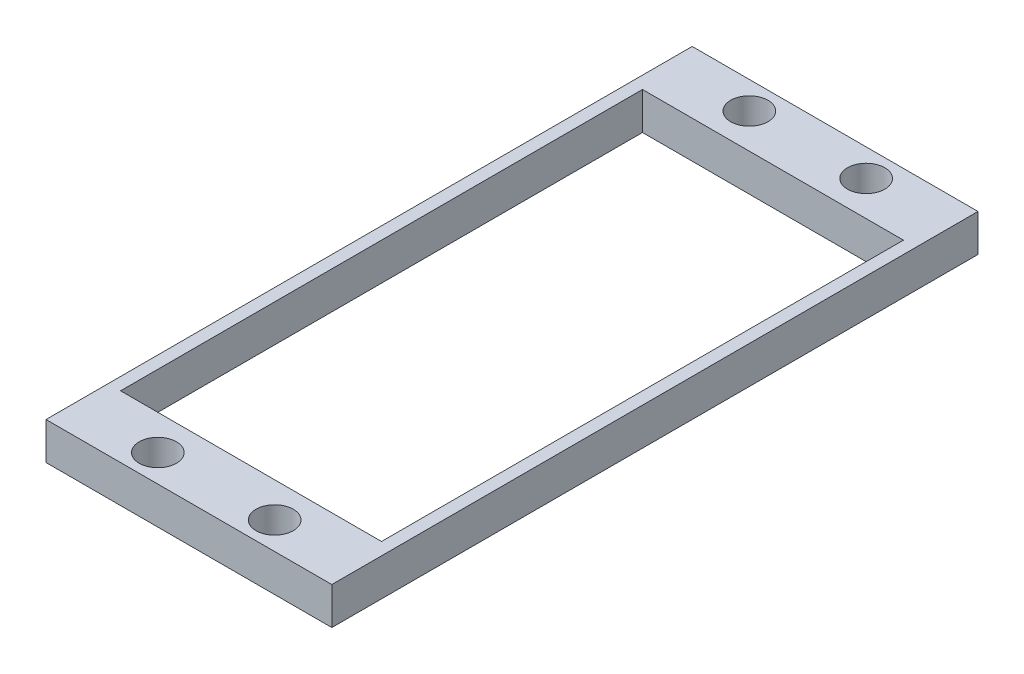
ISO-10303-21;
HEADER;
FILE_DESCRIPTION(('STEP AP214'),'2;1');
FILE_NAME('part.step','',(''),(''),'','','');
FILE_SCHEMA(('AUTOMOTIVE_DESIGN { 1 0 10303 214 1 1 1 1 }'));
ENDSEC;
DATA;
#1=APPLICATION_CONTEXT('core data for automotive mechanical design processes');
#2=APPLICATION_PROTOCOL_DEFINITION('international standard','automotive_design',2000,#1);
#3=PRODUCT_CONTEXT('',#1,'mechanical');
#4=PRODUCT('Part','Part','',(#3));
#5=PRODUCT_RELATED_PRODUCT_CATEGORY('part','',(#4));
#6=PRODUCT_DEFINITION_FORMATION('','',#4);
#7=PRODUCT_DEFINITION_CONTEXT('part definition',#1,'design');
#8=PRODUCT_DEFINITION('design','',#6,#7);
#9=PRODUCT_DEFINITION_SHAPE('','',#8);
#10=(LENGTH_UNIT() NAMED_UNIT(*) SI_UNIT(.MILLI.,.METRE.));
#11=(NAMED_UNIT(*) PLANE_ANGLE_UNIT() SI_UNIT($,.RADIAN.));
#12=(NAMED_UNIT(*) SI_UNIT($,.STERADIAN.) SOLID_ANGLE_UNIT());
#13=UNCERTAINTY_MEASURE_WITH_UNIT(LENGTH_MEASURE(1.E-05),#10,'distance_accuracy_value','');
#14=(GEOMETRIC_REPRESENTATION_CONTEXT(3) GLOBAL_UNCERTAINTY_ASSIGNED_CONTEXT((#13)) GLOBAL_UNIT_ASSIGNED_CONTEXT((#10,
#11,#12)) REPRESENTATION_CONTEXT('',''));
#15=CARTESIAN_POINT('',(0.,0.,0.));
#16=DIRECTION('',(0.,0.,1.));
#17=DIRECTION('',(1.,0.,0.));
#18=AXIS2_PLACEMENT_3D('',#15,#16,#17);
#19=CARTESIAN_POINT('',(0.,3.,0.));
#20=DIRECTION('',(0.,-1.,0.));
#21=DIRECTION('',(0.,0.,-1.));
#22=AXIS2_PLACEMENT_3D('',#19,#20,#21);
#23=PLANE('',#22);
#24=DIRECTION('',(0.,0.,1.));
#25=VECTOR('',#24,1.);
#26=CARTESIAN_POINT('',(-11.5,3.,-22.));
#27=LINE('',#26,#25);
#28=CARTESIAN_POINT('',(-11.5,3.,-26.));
#29=VERTEX_POINT('',#28);
#30=CARTESIAN_POINT('',(-11.5,3.,26.));
#31=VERTEX_POINT('',#30);
#32=EDGE_CURVE('E140',#29,#31,#27,.T.);
#33=ORIENTED_EDGE('',*,*,#32,.T.);
#34=DIRECTION('',(1.,0.,0.));
#35=VECTOR('',#34,1.);
#36=CARTESIAN_POINT('',(-11.5,3.,26.));
#37=LINE('',#36,#35);
#38=CARTESIAN_POINT('',(11.5,3.,26.));
#39=VERTEX_POINT('',#38);
#40=EDGE_CURVE('E142',#31,#39,#37,.T.);
#41=ORIENTED_EDGE('',*,*,#40,.T.);
#42=DIRECTION('',(0.,0.,-1.));
#43=VECTOR('',#42,1.);
#44=CARTESIAN_POINT('',(11.5,3.,22.));
#45=LINE('',#44,#43);
#46=CARTESIAN_POINT('',(11.5,3.,-26.));
#47=VERTEX_POINT('',#46);
#48=EDGE_CURVE('E145',#39,#47,#45,.T.);
#49=ORIENTED_EDGE('',*,*,#48,.T.);
#50=DIRECTION('',(-1.,0.,0.));
#51=VECTOR('',#50,1.);
#52=CARTESIAN_POINT('',(-11.5,3.,-26.));
#53=LINE('',#52,#51);
#54=EDGE_CURVE('E147',#47,#29,#53,.T.);
#55=ORIENTED_EDGE('',*,*,#54,.T.);
#56=EDGE_LOOP('',(#33,#41,#49,#55));
#57=FACE_BOUND('',#56,.T.);
#58=DIRECTION('',(0.,0.,1.));
#59=VECTOR('',#58,1.);
#60=CARTESIAN_POINT('',(-10.5,3.,-21.));
#61=LINE('',#60,#59);
#62=CARTESIAN_POINT('',(-10.5,3.,-21.));
#63=VERTEX_POINT('',#62);
#64=CARTESIAN_POINT('',(-10.5,3.,21.));
#65=VERTEX_POINT('',#64);
#66=EDGE_CURVE('E101',#63,#65,#61,.T.);
#67=ORIENTED_EDGE('',*,*,#66,.F.);
#68=DIRECTION('',(-1.,0.,0.));
#69=VECTOR('',#68,1.);
#70=CARTESIAN_POINT('',(-10.5,3.,-21.));
#71=LINE('',#70,#69);
#72=CARTESIAN_POINT('',(10.5,3.,-21.));
#73=VERTEX_POINT('',#72);
#74=EDGE_CURVE('E124',#73,#63,#71,.T.);
#75=ORIENTED_EDGE('',*,*,#74,.F.);
#76=DIRECTION('',(0.,0.,-1.));
#77=VECTOR('',#76,1.);
#78=CARTESIAN_POINT('',(10.5,3.,-21.));
#79=LINE('',#78,#77);
#80=CARTESIAN_POINT('',(10.5,3.,21.));
#81=VERTEX_POINT('',#80);
#82=EDGE_CURVE('E122',#81,#73,#79,.T.);
#83=ORIENTED_EDGE('',*,*,#82,.F.);
#84=DIRECTION('',(1.,0.,0.));
#85=VECTOR('',#84,1.);
#86=CARTESIAN_POINT('',(-10.5,3.,21.));
#87=LINE('',#86,#85);
#88=EDGE_CURVE('E109',#65,#81,#87,.T.);
#89=ORIENTED_EDGE('',*,*,#88,.F.);
#90=EDGE_LOOP('',(#67,#75,#83,#89));
#91=FACE_BOUND('',#90,.T.);
#92=CARTESIAN_POINT('',(-4.7,3.,-23.8));
#93=DIRECTION('',(0.,1.,0.));
#94=DIRECTION('',(0.,0.,1.));
#95=AXIS2_PLACEMENT_3D('',#92,#93,#94);
#96=CIRCLE('',#95,1.5);
#97=CARTESIAN_POINT('',(-4.7,3.,-22.3));
#98=VERTEX_POINT('',#97);
#99=EDGE_CURVE('E130',#98,#98,#96,.T.);
#100=ORIENTED_EDGE('',*,*,#99,.F.);
#101=EDGE_LOOP('',(#100));
#102=FACE_BOUND('',#101,.T.);
#103=CARTESIAN_POINT('',(4.7,3.,-23.8));
#104=DIRECTION('',(0.,1.,0.));
#105=DIRECTION('',(0.,0.,1.));
#106=AXIS2_PLACEMENT_3D('',#103,#104,#105);
#107=CIRCLE('',#106,1.5);
#108=CARTESIAN_POINT('',(4.7,3.,-22.3));
#109=VERTEX_POINT('',#108);
#110=EDGE_CURVE('E336',#109,#109,#107,.T.);
#111=ORIENTED_EDGE('',*,*,#110,.F.);
#112=EDGE_LOOP('',(#111));
#113=FACE_BOUND('',#112,.T.);
#114=CARTESIAN_POINT('',(4.7,3.,23.8));
#115=DIRECTION('',(0.,1.,0.));
#116=DIRECTION('',(0.,0.,-1.));
#117=AXIS2_PLACEMENT_3D('',#114,#115,#116);
#118=CIRCLE('',#117,1.5);
#119=CARTESIAN_POINT('',(4.7,3.,22.3));
#120=VERTEX_POINT('',#119);
#121=EDGE_CURVE('E330',#120,#120,#118,.T.);
#122=ORIENTED_EDGE('',*,*,#121,.F.);
#123=EDGE_LOOP('',(#122));
#124=FACE_BOUND('',#123,.T.);
#125=CARTESIAN_POINT('',(-4.7,3.,23.8));
#126=DIRECTION('',(0.,1.,0.));
#127=DIRECTION('',(0.,0.,-1.));
#128=AXIS2_PLACEMENT_3D('',#125,#126,#127);
#129=CIRCLE('',#128,1.5);
#130=CARTESIAN_POINT('',(-4.7,3.,22.3));
#131=VERTEX_POINT('',#130);
#132=EDGE_CURVE('E321',#131,#131,#129,.T.);
#133=ORIENTED_EDGE('',*,*,#132,.F.);
#134=EDGE_LOOP('',(#133));
#135=FACE_BOUND('',#134,.T.);
#136=ADVANCED_FACE('F36',(#57,#91,#102,#113,#124,#135),#23,.F.);
#137=CARTESIAN_POINT('',(0.,0.,0.));
#138=DIRECTION('',(0.,-1.,0.));
#139=DIRECTION('',(0.,0.,-1.));
#140=AXIS2_PLACEMENT_3D('',#137,#138,#139);
#141=PLANE('',#140);
#142=CARTESIAN_POINT('',(4.7,0.,23.8));
#143=DIRECTION('',(0.,1.,0.));
#144=DIRECTION('',(0.,0.,-1.));
#145=AXIS2_PLACEMENT_3D('',#142,#143,#144);
#146=CIRCLE('',#145,1.5);
#147=CARTESIAN_POINT('',(4.7,0.,22.3));
#148=VERTEX_POINT('',#147);
#149=EDGE_CURVE('E327',#148,#148,#146,.T.);
#150=ORIENTED_EDGE('',*,*,#149,.T.);
#151=EDGE_LOOP('',(#150));
#152=FACE_BOUND('',#151,.T.);
#153=CARTESIAN_POINT('',(-4.7,0.,-23.8));
#154=DIRECTION('',(0.,1.,0.));
#155=DIRECTION('',(0.,0.,1.));
#156=AXIS2_PLACEMENT_3D('',#153,#154,#155);
#157=CIRCLE('',#156,1.5);
#158=CARTESIAN_POINT('',(-4.7,0.,-22.3));
#159=VERTEX_POINT('',#158);
#160=EDGE_CURVE('E339',#159,#159,#157,.T.);
#161=ORIENTED_EDGE('',*,*,#160,.T.);
#162=EDGE_LOOP('',(#161));
#163=FACE_BOUND('',#162,.T.);
#164=DIRECTION('',(0.,0.,1.));
#165=VECTOR('',#164,1.);
#166=CARTESIAN_POINT('',(-11.5,0.,22.));
#167=LINE('',#166,#165);
#168=CARTESIAN_POINT('',(-11.5,0.,-26.));
#169=VERTEX_POINT('',#168);
#170=CARTESIAN_POINT('',(-11.5,0.,26.));
#171=VERTEX_POINT('',#170);
#172=EDGE_CURVE('E117',#169,#171,#167,.T.);
#173=ORIENTED_EDGE('',*,*,#172,.F.);
#174=DIRECTION('',(-1.,0.,0.));
#175=VECTOR('',#174,1.);
#176=CARTESIAN_POINT('',(-11.5,0.,-26.));
#177=LINE('',#176,#175);
#178=CARTESIAN_POINT('',(11.5,0.,-26.));
#179=VERTEX_POINT('',#178);
#180=EDGE_CURVE('E143',#179,#169,#177,.T.);
#181=ORIENTED_EDGE('',*,*,#180,.F.);
#182=DIRECTION('',(0.,0.,-1.));
#183=VECTOR('',#182,1.);
#184=CARTESIAN_POINT('',(11.5,0.,-22.));
#185=LINE('',#184,#183);
#186=CARTESIAN_POINT('',(11.5,0.,26.));
#187=VERTEX_POINT('',#186);
#188=EDGE_CURVE('E154',#187,#179,#185,.T.);
#189=ORIENTED_EDGE('',*,*,#188,.F.);
#190=DIRECTION('',(1.,0.,0.));
#191=VECTOR('',#190,1.);
#192=CARTESIAN_POINT('',(-11.5,0.,26.));
#193=LINE('',#192,#191);
#194=EDGE_CURVE('E151',#171,#187,#193,.T.);
#195=ORIENTED_EDGE('',*,*,#194,.F.);
#196=EDGE_LOOP('',(#173,#181,#189,#195));
#197=FACE_BOUND('',#196,.T.);
#198=DIRECTION('',(-1.,0.,0.));
#199=VECTOR('',#198,1.);
#200=CARTESIAN_POINT('',(-10.5,0.,-21.));
#201=LINE('',#200,#199);
#202=CARTESIAN_POINT('',(10.5,0.,-21.));
#203=VERTEX_POINT('',#202);
#204=CARTESIAN_POINT('',(-10.5,0.,-21.));
#205=VERTEX_POINT('',#204);
#206=EDGE_CURVE('E110',#203,#205,#201,.T.);
#207=ORIENTED_EDGE('',*,*,#206,.T.);
#208=DIRECTION('',(0.,0.,1.));
#209=VECTOR('',#208,1.);
#210=CARTESIAN_POINT('',(-10.5,0.,-21.));
#211=LINE('',#210,#209);
#212=CARTESIAN_POINT('',(-10.5,0.,21.));
#213=VERTEX_POINT('',#212);
#214=EDGE_CURVE('E59',#205,#213,#211,.T.);
#215=ORIENTED_EDGE('',*,*,#214,.T.);
#216=DIRECTION('',(1.,0.,0.));
#217=VECTOR('',#216,1.);
#218=CARTESIAN_POINT('',(-10.5,0.,21.));
#219=LINE('',#218,#217);
#220=CARTESIAN_POINT('',(10.5,0.,21.));
#221=VERTEX_POINT('',#220);
#222=EDGE_CURVE('E116',#213,#221,#219,.T.);
#223=ORIENTED_EDGE('',*,*,#222,.T.);
#224=DIRECTION('',(0.,0.,-1.));
#225=VECTOR('',#224,1.);
#226=CARTESIAN_POINT('',(10.5,0.,-21.));
#227=LINE('',#226,#225);
#228=EDGE_CURVE('E132',#221,#203,#227,.T.);
#229=ORIENTED_EDGE('',*,*,#228,.T.);
#230=EDGE_LOOP('',(#207,#215,#223,#229));
#231=FACE_BOUND('',#230,.T.);
#232=CARTESIAN_POINT('',(4.7,0.,-23.8));
#233=DIRECTION('',(0.,1.,0.));
#234=DIRECTION('',(0.,0.,1.));
#235=AXIS2_PLACEMENT_3D('',#232,#233,#234);
#236=CIRCLE('',#235,1.5);
#237=CARTESIAN_POINT('',(4.7,0.,-22.3));
#238=VERTEX_POINT('',#237);
#239=EDGE_CURVE('E333',#238,#238,#236,.T.);
#240=ORIENTED_EDGE('',*,*,#239,.T.);
#241=EDGE_LOOP('',(#240));
#242=FACE_BOUND('',#241,.T.);
#243=CARTESIAN_POINT('',(-4.7,0.,23.8));
#244=DIRECTION('',(0.,1.,0.));
#245=DIRECTION('',(0.,0.,-1.));
#246=AXIS2_PLACEMENT_3D('',#243,#244,#245);
#247=CIRCLE('',#246,1.5);
#248=CARTESIAN_POINT('',(-4.7,0.,22.3));
#249=VERTEX_POINT('',#248);
#250=EDGE_CURVE('E324',#249,#249,#247,.T.);
#251=ORIENTED_EDGE('',*,*,#250,.T.);
#252=EDGE_LOOP('',(#251));
#253=FACE_BOUND('',#252,.T.);
#254=ADVANCED_FACE('F174',(#152,#163,#197,#231,#242,#253),#141,.T.);
#255=CARTESIAN_POINT('',(-11.5,3.,22.));
#256=DIRECTION('',(1.,0.,0.));
#257=DIRECTION('',(0.,0.,-1.));
#258=AXIS2_PLACEMENT_3D('',#255,#256,#257);
#259=PLANE('',#258);
#260=ORIENTED_EDGE('',*,*,#172,.T.);
#261=DIRECTION('',(0.,-1.,0.));
#262=VECTOR('',#261,1.);
#263=CARTESIAN_POINT('',(-11.5,3.,26.));
#264=LINE('',#263,#262);
#265=EDGE_CURVE('E11',#31,#171,#264,.T.);
#266=ORIENTED_EDGE('',*,*,#265,.F.);
#267=ORIENTED_EDGE('',*,*,#32,.F.);
#268=DIRECTION('',(0.,-1.,0.));
#269=VECTOR('',#268,1.);
#270=CARTESIAN_POINT('',(-11.5,3.,-26.));
#271=LINE('',#270,#269);
#272=EDGE_CURVE('E149',#29,#169,#271,.T.);
#273=ORIENTED_EDGE('',*,*,#272,.T.);
#274=EDGE_LOOP('',(#260,#266,#267,#273));
#275=FACE_BOUND('',#274,.T.);
#276=ADVANCED_FACE('F38',(#275),#259,.F.);
#277=CARTESIAN_POINT('',(-11.5,3.,26.));
#278=DIRECTION('',(0.,0.,-1.));
#279=DIRECTION('',(-1.,0.,0.));
#280=AXIS2_PLACEMENT_3D('',#277,#278,#279);
#281=PLANE('',#280);
#282=ORIENTED_EDGE('',*,*,#194,.T.);
#283=DIRECTION('',(0.,-1.,0.));
#284=VECTOR('',#283,1.);
#285=CARTESIAN_POINT('',(11.5,3.,26.));
#286=LINE('',#285,#284);
#287=EDGE_CURVE('E44',#39,#187,#286,.T.);
#288=ORIENTED_EDGE('',*,*,#287,.F.);
#289=ORIENTED_EDGE('',*,*,#40,.F.);
#290=ORIENTED_EDGE('',*,*,#265,.T.);
#291=EDGE_LOOP('',(#282,#288,#289,#290));
#292=FACE_BOUND('',#291,.T.);
#293=ADVANCED_FACE('F170',(#292),#281,.F.);
#294=CARTESIAN_POINT('',(11.5,3.,-22.));
#295=DIRECTION('',(-1.,0.,0.));
#296=DIRECTION('',(0.,0.,1.));
#297=AXIS2_PLACEMENT_3D('',#294,#295,#296);
#298=PLANE('',#297);
#299=ORIENTED_EDGE('',*,*,#188,.T.);
#300=DIRECTION('',(0.,-1.,0.));
#301=VECTOR('',#300,1.);
#302=CARTESIAN_POINT('',(11.5,3.,-26.));
#303=LINE('',#302,#301);
#304=EDGE_CURVE('E160',#47,#179,#303,.T.);
#305=ORIENTED_EDGE('',*,*,#304,.F.);
#306=ORIENTED_EDGE('',*,*,#48,.F.);
#307=ORIENTED_EDGE('',*,*,#287,.T.);
#308=EDGE_LOOP('',(#299,#305,#306,#307));
#309=FACE_BOUND('',#308,.T.);
#310=ADVANCED_FACE('F166',(#309),#298,.F.);
#311=CARTESIAN_POINT('',(-11.5,3.,-26.));
#312=DIRECTION('',(0.,0.,1.));
#313=DIRECTION('',(1.,0.,0.));
#314=AXIS2_PLACEMENT_3D('',#311,#312,#313);
#315=PLANE('',#314);
#316=ORIENTED_EDGE('',*,*,#180,.T.);
#317=ORIENTED_EDGE('',*,*,#272,.F.);
#318=ORIENTED_EDGE('',*,*,#54,.F.);
#319=ORIENTED_EDGE('',*,*,#304,.T.);
#320=EDGE_LOOP('',(#316,#317,#318,#319));
#321=FACE_BOUND('',#320,.T.);
#322=ADVANCED_FACE('F179',(#321),#315,.F.);
#323=CARTESIAN_POINT('',(-10.5,3.,-21.));
#324=DIRECTION('',(1.,0.,0.));
#325=DIRECTION('',(0.,0.,-1.));
#326=AXIS2_PLACEMENT_3D('',#323,#324,#325);
#327=PLANE('',#326);
#328=ORIENTED_EDGE('',*,*,#214,.F.);
#329=DIRECTION('',(0.,-1.,0.));
#330=VECTOR('',#329,1.);
#331=CARTESIAN_POINT('',(-10.5,3.,-21.));
#332=LINE('',#331,#330);
#333=EDGE_CURVE('E105',#63,#205,#332,.T.);
#334=ORIENTED_EDGE('',*,*,#333,.F.);
#335=ORIENTED_EDGE('',*,*,#66,.T.);
#336=DIRECTION('',(0.,-1.,0.));
#337=VECTOR('',#336,1.);
#338=CARTESIAN_POINT('',(-10.5,3.,21.));
#339=LINE('',#338,#337);
#340=EDGE_CURVE('E104',#65,#213,#339,.T.);
#341=ORIENTED_EDGE('',*,*,#340,.T.);
#342=EDGE_LOOP('',(#328,#334,#335,#341));
#343=FACE_BOUND('',#342,.T.);
#344=ADVANCED_FACE('F103',(#343),#327,.T.);
#345=CARTESIAN_POINT('',(-10.5,3.,21.));
#346=DIRECTION('',(0.,0.,-1.));
#347=DIRECTION('',(-1.,0.,0.));
#348=AXIS2_PLACEMENT_3D('',#345,#346,#347);
#349=PLANE('',#348);
#350=ORIENTED_EDGE('',*,*,#222,.F.);
#351=ORIENTED_EDGE('',*,*,#340,.F.);
#352=ORIENTED_EDGE('',*,*,#88,.T.);
#353=DIRECTION('',(0.,-1.,0.));
#354=VECTOR('',#353,1.);
#355=CARTESIAN_POINT('',(10.5,3.,21.));
#356=LINE('',#355,#354);
#357=EDGE_CURVE('E118',#81,#221,#356,.T.);
#358=ORIENTED_EDGE('',*,*,#357,.T.);
#359=EDGE_LOOP('',(#350,#351,#352,#358));
#360=FACE_BOUND('',#359,.T.);
#361=ADVANCED_FACE('F113',(#360),#349,.T.);
#362=CARTESIAN_POINT('',(10.5,3.,-21.));
#363=DIRECTION('',(-1.,0.,0.));
#364=DIRECTION('',(0.,0.,1.));
#365=AXIS2_PLACEMENT_3D('',#362,#363,#364);
#366=PLANE('',#365);
#367=ORIENTED_EDGE('',*,*,#228,.F.);
#368=ORIENTED_EDGE('',*,*,#357,.F.);
#369=ORIENTED_EDGE('',*,*,#82,.T.);
#370=DIRECTION('',(0.,-1.,0.));
#371=VECTOR('',#370,1.);
#372=CARTESIAN_POINT('',(10.5,3.,-21.));
#373=LINE('',#372,#371);
#374=EDGE_CURVE('E51',#73,#203,#373,.T.);
#375=ORIENTED_EDGE('',*,*,#374,.T.);
#376=EDGE_LOOP('',(#367,#368,#369,#375));
#377=FACE_BOUND('',#376,.T.);
#378=ADVANCED_FACE('F255',(#377),#366,.T.);
#379=CARTESIAN_POINT('',(-10.5,3.,-21.));
#380=DIRECTION('',(0.,0.,1.));
#381=DIRECTION('',(1.,0.,0.));
#382=AXIS2_PLACEMENT_3D('',#379,#380,#381);
#383=PLANE('',#382);
#384=ORIENTED_EDGE('',*,*,#206,.F.);
#385=ORIENTED_EDGE('',*,*,#374,.F.);
#386=ORIENTED_EDGE('',*,*,#74,.T.);
#387=ORIENTED_EDGE('',*,*,#333,.T.);
#388=EDGE_LOOP('',(#384,#385,#386,#387));
#389=FACE_BOUND('',#388,.T.);
#390=ADVANCED_FACE('F262',(#389),#383,.T.);
#391=CARTESIAN_POINT('',(-4.7,3.,-23.8));
#392=DIRECTION('',(0.,-1.,0.));
#393=DIRECTION('',(0.,0.,-1.));
#394=AXIS2_PLACEMENT_3D('',#391,#392,#393);
#395=CYLINDRICAL_SURFACE('',#394,1.5);
#396=ORIENTED_EDGE('',*,*,#99,.T.);
#397=EDGE_LOOP('',(#396));
#398=FACE_BOUND('',#397,.T.);
#399=ORIENTED_EDGE('',*,*,#160,.F.);
#400=EDGE_LOOP('',(#399));
#401=FACE_BOUND('',#400,.T.);
#402=ADVANCED_FACE('F271',(#398,#401),#395,.F.);
#403=CARTESIAN_POINT('',(4.7,3.,-23.8));
#404=DIRECTION('',(0.,-1.,0.));
#405=DIRECTION('',(0.,0.,-1.));
#406=AXIS2_PLACEMENT_3D('',#403,#404,#405);
#407=CYLINDRICAL_SURFACE('',#406,1.5);
#408=ORIENTED_EDGE('',*,*,#110,.T.);
#409=EDGE_LOOP('',(#408));
#410=FACE_BOUND('',#409,.T.);
#411=ORIENTED_EDGE('',*,*,#239,.F.);
#412=EDGE_LOOP('',(#411));
#413=FACE_BOUND('',#412,.T.);
#414=ADVANCED_FACE('F279',(#410,#413),#407,.F.);
#415=CARTESIAN_POINT('',(4.7,3.,23.8));
#416=DIRECTION('',(0.,-1.,0.));
#417=DIRECTION('',(0.,0.,-1.));
#418=AXIS2_PLACEMENT_3D('',#415,#416,#417);
#419=CYLINDRICAL_SURFACE('',#418,1.5);
#420=ORIENTED_EDGE('',*,*,#121,.T.);
#421=EDGE_LOOP('',(#420));
#422=FACE_BOUND('',#421,.T.);
#423=ORIENTED_EDGE('',*,*,#149,.F.);
#424=EDGE_LOOP('',(#423));
#425=FACE_BOUND('',#424,.T.);
#426=ADVANCED_FACE('F288',(#422,#425),#419,.F.);
#427=CARTESIAN_POINT('',(-4.7,3.,23.8));
#428=DIRECTION('',(0.,-1.,0.));
#429=DIRECTION('',(0.,0.,-1.));
#430=AXIS2_PLACEMENT_3D('',#427,#428,#429);
#431=CYLINDRICAL_SURFACE('',#430,1.5);
#432=ORIENTED_EDGE('',*,*,#132,.T.);
#433=EDGE_LOOP('',(#432));
#434=FACE_BOUND('',#433,.T.);
#435=ORIENTED_EDGE('',*,*,#250,.F.);
#436=EDGE_LOOP('',(#435));
#437=FACE_BOUND('',#436,.T.);
#438=ADVANCED_FACE('F297',(#434,#437),#431,.F.);
#439=CLOSED_SHELL('',(#136,#254,#276,#293,#310,#322,#344,#361,#378,#390,#402,#414,#426,#438));
#440=MANIFOLD_SOLID_BREP('B2',#439);
#441=ADVANCED_BREP_SHAPE_REPRESENTATION('',(#18,#440),#14);
#442=SHAPE_DEFINITION_REPRESENTATION(#9,#441);
ENDSEC;
END-ISO-10303-21;
